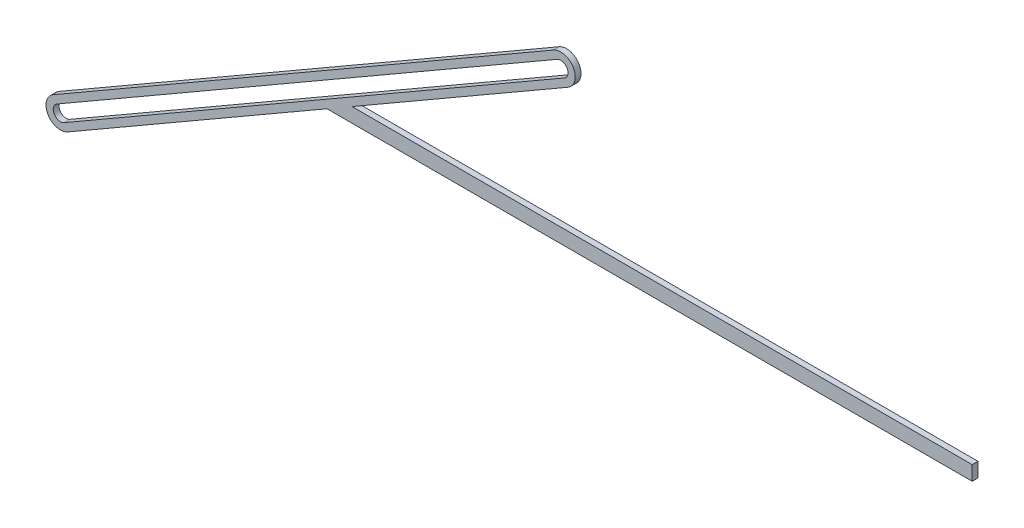
ISO-10303-21;
HEADER;
FILE_DESCRIPTION(('STEP AP214'),'2;1');
FILE_NAME('part.step','',(''),(''),'','','');
FILE_SCHEMA(('AUTOMOTIVE_DESIGN { 1 0 10303 214 1 1 1 1 }'));
ENDSEC;
DATA;
#1=APPLICATION_CONTEXT('core data for automotive mechanical design processes');
#2=APPLICATION_PROTOCOL_DEFINITION('international standard','automotive_design',2000,#1);
#3=PRODUCT_CONTEXT('',#1,'mechanical');
#4=PRODUCT('Part','Part','',(#3));
#5=PRODUCT_RELATED_PRODUCT_CATEGORY('part','',(#4));
#6=PRODUCT_DEFINITION_FORMATION('','',#4);
#7=PRODUCT_DEFINITION_CONTEXT('part definition',#1,'design');
#8=PRODUCT_DEFINITION('design','',#6,#7);
#9=PRODUCT_DEFINITION_SHAPE('','',#8);
#10=(LENGTH_UNIT() NAMED_UNIT(*) SI_UNIT(.MILLI.,.METRE.));
#11=(NAMED_UNIT(*) PLANE_ANGLE_UNIT() SI_UNIT($,.RADIAN.));
#12=(NAMED_UNIT(*) SI_UNIT($,.STERADIAN.) SOLID_ANGLE_UNIT());
#13=UNCERTAINTY_MEASURE_WITH_UNIT(LENGTH_MEASURE(1.E-05),#10,'distance_accuracy_value','');
#14=(GEOMETRIC_REPRESENTATION_CONTEXT(3) GLOBAL_UNCERTAINTY_ASSIGNED_CONTEXT((#13)) GLOBAL_UNIT_ASSIGNED_CONTEXT((#10,
#11,#12)) REPRESENTATION_CONTEXT('',''));
#15=CARTESIAN_POINT('',(0.,0.,0.));
#16=DIRECTION('',(0.,0.,1.));
#17=DIRECTION('',(1.,0.,0.));
#18=AXIS2_PLACEMENT_3D('',#15,#16,#17);
#19=CARTESIAN_POINT('',(-52.1269965372353,100.,4.));
#20=DIRECTION('',(0.,0.,1.));
#21=DIRECTION('',(1.,0.,0.));
#22=AXIS2_PLACEMENT_3D('',#19,#20,#21);
#23=PLANE('',#22);
#24=DIRECTION('',(1.,0.,0.));
#25=VECTOR('',#24,1.);
#26=CARTESIAN_POINT('',(-213.992331331968,-5.00000000000003,4.));
#27=LINE('',#26,#25);
#28=CARTESIAN_POINT('',(-213.992331331968,-5.00000000000003,4.));
#29=VERTEX_POINT('',#28);
#30=CARTESIAN_POINT('',(232.716639261511,-5.00000000000002,4.));
#31=VERTEX_POINT('',#30);
#32=EDGE_CURVE('E156',#29,#31,#27,.T.);
#33=ORIENTED_EDGE('',*,*,#32,.T.);
#34=DIRECTION('',(0.,1.,0.));
#35=VECTOR('',#34,1.);
#36=CARTESIAN_POINT('',(232.716639261511,5.00000000000001,4.));
#37=LINE('',#36,#35);
#38=CARTESIAN_POINT('',(232.716639261511,5.00000000000001,4.));
#39=VERTEX_POINT('',#38);
#40=EDGE_CURVE('E158',#31,#39,#37,.T.);
#41=ORIENTED_EDGE('',*,*,#40,.T.);
#42=DIRECTION('',(-1.,0.,0.));
#43=VECTOR('',#42,1.);
#44=CARTESIAN_POINT('',(162.432840625087,5.00000000000001,4.));
#45=LINE('',#44,#43);
#46=CARTESIAN_POINT('',(-196.671823256279,5.00000000000002,4.));
#47=VERTEX_POINT('',#46);
#48=EDGE_CURVE('E161',#39,#47,#45,.T.);
#49=ORIENTED_EDGE('',*,*,#48,.T.);
#50=DIRECTION('',(0.866025403784437,0.500000000000003,0.));
#51=VECTOR('',#50,1.);
#52=CARTESIAN_POINT('',(-196.671823256279,5.00000000000002,4.));
#53=LINE('',#52,#51);
#54=CARTESIAN_POINT('',(-47.1269965372357,91.3397459621565,4.));
#55=VERTEX_POINT('',#54);
#56=EDGE_CURVE('E163',#47,#55,#53,.T.);
#57=ORIENTED_EDGE('',*,*,#56,.T.);
#58=CARTESIAN_POINT('',(-52.1269965372353,100.,4.));
#59=DIRECTION('',(0.,0.,1.));
#60=DIRECTION('',(1.,0.,0.));
#61=AXIS2_PLACEMENT_3D('',#58,#59,#60);
#62=CIRCLE('',#61,9.99999999999931);
#63=CARTESIAN_POINT('',(-57.1269965372349,108.660254037844,4.));
#64=VERTEX_POINT('',#63);
#65=EDGE_CURVE('E165',#55,#64,#62,.T.);
#66=ORIENTED_EDGE('',*,*,#65,.T.);
#67=DIRECTION('',(-0.866025403784439,-0.5,0.));
#68=VECTOR('',#67,1.);
#69=CARTESIAN_POINT('',(-403.53715805101,-91.339745962156,4.));
#70=LINE('',#69,#68);
#71=CARTESIAN_POINT('',(-403.537158051011,-91.3397459621558,4.));
#72=VERTEX_POINT('',#71);
#73=EDGE_CURVE('E167',#64,#72,#70,.T.);
#74=ORIENTED_EDGE('',*,*,#73,.T.);
#75=CARTESIAN_POINT('',(-398.537158051011,-100.,4.));
#76=DIRECTION('',(0.,0.,1.));
#77=DIRECTION('',(1.,0.,0.));
#78=AXIS2_PLACEMENT_3D('',#75,#76,#77);
#79=CIRCLE('',#78,10.);
#80=CARTESIAN_POINT('',(-393.53715805101,-108.660254037845,4.));
#81=VERTEX_POINT('',#80);
#82=EDGE_CURVE('E169',#72,#81,#79,.T.);
#83=ORIENTED_EDGE('',*,*,#82,.T.);
#84=DIRECTION('',(0.866025403784437,0.500000000000003,0.));
#85=VECTOR('',#84,1.);
#86=CARTESIAN_POINT('',(-393.53715805101,-108.660254037845,4.));
#87=LINE('',#86,#85);
#88=EDGE_CURVE('E171',#81,#29,#87,.T.);
#89=ORIENTED_EDGE('',*,*,#88,.T.);
#90=EDGE_LOOP('',(#33,#41,#49,#57,#66,#74,#83,#89));
#91=FACE_BOUND('',#90,.T.);
#92=DIRECTION('',(0.866025403784438,0.500000000000002,0.));
#93=VECTOR('',#92,1.);
#94=CARTESIAN_POINT('',(-396.03715805101,-104.330127018923,4.));
#95=LINE('',#94,#93);
#96=CARTESIAN_POINT('',(-396.03715805101,-104.330127018923,4.));
#97=VERTEX_POINT('',#96);
#98=CARTESIAN_POINT('',(-49.6269965372355,95.6698729810783,4.));
#99=VERTEX_POINT('',#98);
#100=EDGE_CURVE('E128',#97,#99,#95,.T.);
#101=ORIENTED_EDGE('',*,*,#100,.F.);
#102=CARTESIAN_POINT('',(-398.537158051011,-100.,4.));
#103=DIRECTION('',(0.,0.,1.));
#104=DIRECTION('',(1.,0.,0.));
#105=AXIS2_PLACEMENT_3D('',#102,#103,#104);
#106=CIRCLE('',#105,5.00000000000002);
#107=CARTESIAN_POINT('',(-401.03715805101,-95.6698729810782,4.));
#108=VERTEX_POINT('',#107);
#109=EDGE_CURVE('E120',#108,#97,#106,.T.);
#110=ORIENTED_EDGE('',*,*,#109,.F.);
#111=DIRECTION('',(-0.866025403784438,-0.5,0.));
#112=VECTOR('',#111,1.);
#113=CARTESIAN_POINT('',(-401.03715805101,-95.6698729810782,4.));
#114=LINE('',#113,#112);
#115=CARTESIAN_POINT('',(-54.6269965372349,104.330127018922,4.));
#116=VERTEX_POINT('',#115);
#117=EDGE_CURVE('E142',#116,#108,#114,.T.);
#118=ORIENTED_EDGE('',*,*,#117,.F.);
#119=CARTESIAN_POINT('',(-52.1269965372353,100.,4.));
#120=DIRECTION('',(0.,0.,1.));
#121=DIRECTION('',(1.,0.,0.));
#122=AXIS2_PLACEMENT_3D('',#119,#120,#121);
#123=CIRCLE('',#122,4.99999999999968);
#124=EDGE_CURVE('E140',#99,#116,#123,.T.);
#125=ORIENTED_EDGE('',*,*,#124,.F.);
#126=EDGE_LOOP('',(#101,#110,#118,#125));
#127=FACE_BOUND('',#126,.T.);
#128=ADVANCED_FACE('F31',(#91,#127),#23,.T.);
#129=CARTESIAN_POINT('',(-52.1269965372353,100.,0.));
#130=DIRECTION('',(0.,0.,1.));
#131=DIRECTION('',(1.,0.,0.));
#132=AXIS2_PLACEMENT_3D('',#129,#130,#131);
#133=PLANE('',#132);
#134=DIRECTION('',(1.,0.,0.));
#135=VECTOR('',#134,1.);
#136=CARTESIAN_POINT('',(232.716639261511,-5.00000000000002,0.));
#137=LINE('',#136,#135);
#138=CARTESIAN_POINT('',(-213.992331331968,-5.00000000000003,0.));
#139=VERTEX_POINT('',#138);
#140=CARTESIAN_POINT('',(232.716639261511,-5.00000000000002,0.));
#141=VERTEX_POINT('',#140);
#142=EDGE_CURVE('E136',#139,#141,#137,.T.);
#143=ORIENTED_EDGE('',*,*,#142,.F.);
#144=DIRECTION('',(0.866025403784437,0.500000000000003,0.));
#145=VECTOR('',#144,1.);
#146=CARTESIAN_POINT('',(-393.53715805101,-108.660254037845,0.));
#147=LINE('',#146,#145);
#148=CARTESIAN_POINT('',(-393.53715805101,-108.660254037845,0.));
#149=VERTEX_POINT('',#148);
#150=EDGE_CURVE('E159',#149,#139,#147,.T.);
#151=ORIENTED_EDGE('',*,*,#150,.F.);
#152=CARTESIAN_POINT('',(-398.537158051011,-100.,0.));
#153=DIRECTION('',(0.,0.,1.));
#154=DIRECTION('',(1.,0.,0.));
#155=AXIS2_PLACEMENT_3D('',#152,#153,#154);
#156=CIRCLE('',#155,10.);
#157=CARTESIAN_POINT('',(-403.537158051011,-91.3397459621558,0.));
#158=VERTEX_POINT('',#157);
#159=EDGE_CURVE('E186',#158,#149,#156,.T.);
#160=ORIENTED_EDGE('',*,*,#159,.F.);
#161=DIRECTION('',(-0.866025403784439,-0.5,0.));
#162=VECTOR('',#161,1.);
#163=CARTESIAN_POINT('',(-403.53715805101,-91.339745962156,0.));
#164=LINE('',#163,#162);
#165=CARTESIAN_POINT('',(-57.1269965372349,108.660254037844,0.));
#166=VERTEX_POINT('',#165);
#167=EDGE_CURVE('E184',#166,#158,#164,.T.);
#168=ORIENTED_EDGE('',*,*,#167,.F.);
#169=CARTESIAN_POINT('',(-52.1269965372353,100.,0.));
#170=DIRECTION('',(0.,0.,1.));
#171=DIRECTION('',(1.,0.,0.));
#172=AXIS2_PLACEMENT_3D('',#169,#170,#171);
#173=CIRCLE('',#172,9.99999999999931);
#174=CARTESIAN_POINT('',(-47.1269965372357,91.3397459621565,0.));
#175=VERTEX_POINT('',#174);
#176=EDGE_CURVE('E182',#175,#166,#173,.T.);
#177=ORIENTED_EDGE('',*,*,#176,.F.);
#178=DIRECTION('',(0.866025403784437,0.500000000000003,0.));
#179=VECTOR('',#178,1.);
#180=CARTESIAN_POINT('',(-196.671823256279,5.00000000000002,0.));
#181=LINE('',#180,#179);
#182=CARTESIAN_POINT('',(-196.671823256279,5.00000000000002,0.));
#183=VERTEX_POINT('',#182);
#184=EDGE_CURVE('E180',#183,#175,#181,.T.);
#185=ORIENTED_EDGE('',*,*,#184,.F.);
#186=DIRECTION('',(-1.,0.,0.));
#187=VECTOR('',#186,1.);
#188=CARTESIAN_POINT('',(-196.671823256279,5.00000000000002,0.));
#189=LINE('',#188,#187);
#190=CARTESIAN_POINT('',(232.716639261511,5.00000000000001,0.));
#191=VERTEX_POINT('',#190);
#192=EDGE_CURVE('E178',#191,#183,#189,.T.);
#193=ORIENTED_EDGE('',*,*,#192,.F.);
#194=DIRECTION('',(0.,1.,0.));
#195=VECTOR('',#194,1.);
#196=CARTESIAN_POINT('',(232.716639261511,5.00000000000001,0.));
#197=LINE('',#196,#195);
#198=EDGE_CURVE('E175',#141,#191,#197,.T.);
#199=ORIENTED_EDGE('',*,*,#198,.F.);
#200=EDGE_LOOP('',(#143,#151,#160,#168,#177,#185,#193,#199));
#201=FACE_BOUND('',#200,.T.);
#202=CARTESIAN_POINT('',(-398.537158051011,-100.,0.));
#203=DIRECTION('',(0.,0.,1.));
#204=DIRECTION('',(1.,0.,0.));
#205=AXIS2_PLACEMENT_3D('',#202,#203,#204);
#206=CIRCLE('',#205,5.00000000000002);
#207=CARTESIAN_POINT('',(-401.03715805101,-95.6698729810782,0.));
#208=VERTEX_POINT('',#207);
#209=CARTESIAN_POINT('',(-396.03715805101,-104.330127018923,0.));
#210=VERTEX_POINT('',#209);
#211=EDGE_CURVE('E54',#208,#210,#206,.T.);
#212=ORIENTED_EDGE('',*,*,#211,.T.);
#213=DIRECTION('',(0.866025403784438,0.500000000000002,0.));
#214=VECTOR('',#213,1.);
#215=CARTESIAN_POINT('',(-396.03715805101,-104.330127018923,0.));
#216=LINE('',#215,#214);
#217=CARTESIAN_POINT('',(-49.6269965372355,95.6698729810783,0.));
#218=VERTEX_POINT('',#217);
#219=EDGE_CURVE('E135',#210,#218,#216,.T.);
#220=ORIENTED_EDGE('',*,*,#219,.T.);
#221=CARTESIAN_POINT('',(-52.1269965372353,100.,0.));
#222=DIRECTION('',(0.,0.,1.));
#223=DIRECTION('',(1.,0.,0.));
#224=AXIS2_PLACEMENT_3D('',#221,#222,#223);
#225=CIRCLE('',#224,4.99999999999968);
#226=CARTESIAN_POINT('',(-54.6269965372349,104.330127018922,0.));
#227=VERTEX_POINT('',#226);
#228=EDGE_CURVE('E148',#218,#227,#225,.T.);
#229=ORIENTED_EDGE('',*,*,#228,.T.);
#230=DIRECTION('',(-0.866025403784438,-0.5,0.));
#231=VECTOR('',#230,1.);
#232=CARTESIAN_POINT('',(-401.03715805101,-95.6698729810782,0.));
#233=LINE('',#232,#231);
#234=EDGE_CURVE('E129',#227,#208,#233,.T.);
#235=ORIENTED_EDGE('',*,*,#234,.T.);
#236=EDGE_LOOP('',(#212,#220,#229,#235));
#237=FACE_BOUND('',#236,.T.);
#238=ADVANCED_FACE('F218',(#201,#237),#133,.F.);
#239=CARTESIAN_POINT('',(232.716639261511,-5.00000000000002,4.));
#240=DIRECTION('',(0.,1.,0.));
#241=DIRECTION('',(0.,0.,1.));
#242=AXIS2_PLACEMENT_3D('',#239,#240,#241);
#243=PLANE('',#242);
#244=ORIENTED_EDGE('',*,*,#142,.T.);
#245=DIRECTION('',(0.,0.,-1.));
#246=VECTOR('',#245,1.);
#247=CARTESIAN_POINT('',(232.716639261511,-5.00000000000002,4.));
#248=LINE('',#247,#246);
#249=EDGE_CURVE('E11',#31,#141,#248,.T.);
#250=ORIENTED_EDGE('',*,*,#249,.F.);
#251=ORIENTED_EDGE('',*,*,#32,.F.);
#252=DIRECTION('',(0.,0.,-1.));
#253=VECTOR('',#252,1.);
#254=CARTESIAN_POINT('',(-213.992331331968,-5.00000000000003,4.));
#255=LINE('',#254,#253);
#256=EDGE_CURVE('E173',#29,#139,#255,.T.);
#257=ORIENTED_EDGE('',*,*,#256,.T.);
#258=EDGE_LOOP('',(#244,#250,#251,#257));
#259=FACE_BOUND('',#258,.T.);
#260=ADVANCED_FACE('F33',(#259),#243,.F.);
#261=CARTESIAN_POINT('',(232.716639261511,5.00000000000001,4.));
#262=DIRECTION('',(-1.,0.,0.));
#263=DIRECTION('',(0.,0.,1.));
#264=AXIS2_PLACEMENT_3D('',#261,#262,#263);
#265=PLANE('',#264);
#266=ORIENTED_EDGE('',*,*,#198,.T.);
#267=DIRECTION('',(0.,0.,-1.));
#268=VECTOR('',#267,1.);
#269=CARTESIAN_POINT('',(232.716639261511,5.00000000000001,4.));
#270=LINE('',#269,#268);
#271=EDGE_CURVE('E39',#39,#191,#270,.T.);
#272=ORIENTED_EDGE('',*,*,#271,.F.);
#273=ORIENTED_EDGE('',*,*,#40,.F.);
#274=ORIENTED_EDGE('',*,*,#249,.T.);
#275=EDGE_LOOP('',(#266,#272,#273,#274));
#276=FACE_BOUND('',#275,.T.);
#277=ADVANCED_FACE('F214',(#276),#265,.F.);
#278=CARTESIAN_POINT('',(-196.671823256279,5.00000000000002,4.));
#279=DIRECTION('',(0.,-1.,0.));
#280=DIRECTION('',(1.,0.,0.));
#281=AXIS2_PLACEMENT_3D('',#278,#279,#280);
#282=PLANE('',#281);
#283=ORIENTED_EDGE('',*,*,#192,.T.);
#284=DIRECTION('',(0.,0.,-1.));
#285=VECTOR('',#284,1.);
#286=CARTESIAN_POINT('',(-196.671823256279,5.00000000000002,4.));
#287=LINE('',#286,#285);
#288=EDGE_CURVE('E204',#47,#183,#287,.T.);
#289=ORIENTED_EDGE('',*,*,#288,.F.);
#290=ORIENTED_EDGE('',*,*,#48,.F.);
#291=ORIENTED_EDGE('',*,*,#271,.T.);
#292=EDGE_LOOP('',(#283,#289,#290,#291));
#293=FACE_BOUND('',#292,.T.);
#294=ADVANCED_FACE('F210',(#293),#282,.F.);
#295=CARTESIAN_POINT('',(-196.671823256279,5.00000000000002,4.));
#296=DIRECTION('',(-0.500000000000003,0.866025403784437,0.));
#297=DIRECTION('',(-0.866025403784437,-0.500000000000003,0.));
#298=AXIS2_PLACEMENT_3D('',#295,#296,#297);
#299=PLANE('',#298);
#300=ORIENTED_EDGE('',*,*,#184,.T.);
#301=DIRECTION('',(0.,0.,-1.));
#302=VECTOR('',#301,1.);
#303=CARTESIAN_POINT('',(-47.1269965372357,91.3397459621565,4.));
#304=LINE('',#303,#302);
#305=EDGE_CURVE('E201',#55,#175,#304,.T.);
#306=ORIENTED_EDGE('',*,*,#305,.F.);
#307=ORIENTED_EDGE('',*,*,#56,.F.);
#308=ORIENTED_EDGE('',*,*,#288,.T.);
#309=EDGE_LOOP('',(#300,#306,#307,#308));
#310=FACE_BOUND('',#309,.T.);
#311=ADVANCED_FACE('F226',(#310),#299,.F.);
#312=CARTESIAN_POINT('',(-52.1269965372353,100.,4.));
#313=DIRECTION('',(0.,0.,-1.));
#314=DIRECTION('',(-1.,0.,0.));
#315=AXIS2_PLACEMENT_3D('',#312,#313,#314);
#316=CYLINDRICAL_SURFACE('',#315,9.99999999999931);
#317=ORIENTED_EDGE('',*,*,#176,.T.);
#318=DIRECTION('',(0.,0.,-1.));
#319=VECTOR('',#318,1.);
#320=CARTESIAN_POINT('',(-57.1269965372349,108.660254037844,4.));
#321=LINE('',#320,#319);
#322=EDGE_CURVE('E198',#64,#166,#321,.T.);
#323=ORIENTED_EDGE('',*,*,#322,.F.);
#324=ORIENTED_EDGE('',*,*,#65,.F.);
#325=ORIENTED_EDGE('',*,*,#305,.T.);
#326=EDGE_LOOP('',(#317,#323,#324,#325));
#327=FACE_BOUND('',#326,.T.);
#328=ADVANCED_FACE('F230',(#327),#316,.T.);
#329=CARTESIAN_POINT('',(-403.53715805101,-91.339745962156,4.));
#330=DIRECTION('',(0.5,-0.866025403784439,0.));
#331=DIRECTION('',(0.866025403784439,0.5,0.));
#332=AXIS2_PLACEMENT_3D('',#329,#330,#331);
#333=PLANE('',#332);
#334=ORIENTED_EDGE('',*,*,#167,.T.);
#335=DIRECTION('',(0.,0.,-1.));
#336=VECTOR('',#335,1.);
#337=CARTESIAN_POINT('',(-403.537158051011,-91.3397459621558,4.));
#338=LINE('',#337,#336);
#339=EDGE_CURVE('E195',#72,#158,#338,.T.);
#340=ORIENTED_EDGE('',*,*,#339,.F.);
#341=ORIENTED_EDGE('',*,*,#73,.F.);
#342=ORIENTED_EDGE('',*,*,#322,.T.);
#343=EDGE_LOOP('',(#334,#340,#341,#342));
#344=FACE_BOUND('',#343,.T.);
#345=ADVANCED_FACE('F247',(#344),#333,.F.);
#346=CARTESIAN_POINT('',(-398.537158051011,-100.,4.));
#347=DIRECTION('',(0.,0.,-1.));
#348=DIRECTION('',(-1.,0.,0.));
#349=AXIS2_PLACEMENT_3D('',#346,#347,#348);
#350=CYLINDRICAL_SURFACE('',#349,10.);
#351=ORIENTED_EDGE('',*,*,#159,.T.);
#352=DIRECTION('',(0.,0.,-1.));
#353=VECTOR('',#352,1.);
#354=CARTESIAN_POINT('',(-393.53715805101,-108.660254037845,4.));
#355=LINE('',#354,#353);
#356=EDGE_CURVE('E192',#81,#149,#355,.T.);
#357=ORIENTED_EDGE('',*,*,#356,.F.);
#358=ORIENTED_EDGE('',*,*,#82,.F.);
#359=ORIENTED_EDGE('',*,*,#339,.T.);
#360=EDGE_LOOP('',(#351,#357,#358,#359));
#361=FACE_BOUND('',#360,.T.);
#362=ADVANCED_FACE('F244',(#361),#350,.T.);
#363=CARTESIAN_POINT('',(-393.53715805101,-108.660254037845,4.));
#364=DIRECTION('',(-0.500000000000003,0.866025403784437,0.));
#365=DIRECTION('',(-0.866025403784437,-0.500000000000003,0.));
#366=AXIS2_PLACEMENT_3D('',#363,#364,#365);
#367=PLANE('',#366);
#368=ORIENTED_EDGE('',*,*,#150,.T.);
#369=ORIENTED_EDGE('',*,*,#256,.F.);
#370=ORIENTED_EDGE('',*,*,#88,.F.);
#371=ORIENTED_EDGE('',*,*,#356,.T.);
#372=EDGE_LOOP('',(#368,#369,#370,#371));
#373=FACE_BOUND('',#372,.T.);
#374=ADVANCED_FACE('F240',(#373),#367,.F.);
#375=CARTESIAN_POINT('',(-398.537158051011,-100.,4.));
#376=DIRECTION('',(0.,0.,-1.));
#377=DIRECTION('',(-1.,0.,0.));
#378=AXIS2_PLACEMENT_3D('',#375,#376,#377);
#379=CYLINDRICAL_SURFACE('',#378,5.00000000000002);
#380=ORIENTED_EDGE('',*,*,#211,.F.);
#381=DIRECTION('',(0.,0.,-1.));
#382=VECTOR('',#381,1.);
#383=CARTESIAN_POINT('',(-401.03715805101,-95.6698729810782,4.));
#384=LINE('',#383,#382);
#385=EDGE_CURVE('E124',#108,#208,#384,.T.);
#386=ORIENTED_EDGE('',*,*,#385,.F.);
#387=ORIENTED_EDGE('',*,*,#109,.T.);
#388=DIRECTION('',(0.,0.,-1.));
#389=VECTOR('',#388,1.);
#390=CARTESIAN_POINT('',(-396.03715805101,-104.330127018923,4.));
#391=LINE('',#390,#389);
#392=EDGE_CURVE('E123',#97,#210,#391,.T.);
#393=ORIENTED_EDGE('',*,*,#392,.T.);
#394=EDGE_LOOP('',(#380,#386,#387,#393));
#395=FACE_BOUND('',#394,.T.);
#396=ADVANCED_FACE('F122',(#395),#379,.F.);
#397=CARTESIAN_POINT('',(-396.03715805101,-104.330127018923,4.));
#398=DIRECTION('',(-0.500000000000002,0.866025403784438,0.));
#399=DIRECTION('',(-0.866025403784438,-0.500000000000002,0.));
#400=AXIS2_PLACEMENT_3D('',#397,#398,#399);
#401=PLANE('',#400);
#402=ORIENTED_EDGE('',*,*,#219,.F.);
#403=ORIENTED_EDGE('',*,*,#392,.F.);
#404=ORIENTED_EDGE('',*,*,#100,.T.);
#405=DIRECTION('',(0.,0.,-1.));
#406=VECTOR('',#405,1.);
#407=CARTESIAN_POINT('',(-49.6269965372355,95.6698729810783,4.));
#408=LINE('',#407,#406);
#409=EDGE_CURVE('E137',#99,#218,#408,.T.);
#410=ORIENTED_EDGE('',*,*,#409,.T.);
#411=EDGE_LOOP('',(#402,#403,#404,#410));
#412=FACE_BOUND('',#411,.T.);
#413=ADVANCED_FACE('F132',(#412),#401,.T.);
#414=CARTESIAN_POINT('',(-52.1269965372353,100.,4.));
#415=DIRECTION('',(0.,0.,-1.));
#416=DIRECTION('',(-1.,0.,0.));
#417=AXIS2_PLACEMENT_3D('',#414,#415,#416);
#418=CYLINDRICAL_SURFACE('',#417,4.99999999999968);
#419=ORIENTED_EDGE('',*,*,#228,.F.);
#420=ORIENTED_EDGE('',*,*,#409,.F.);
#421=ORIENTED_EDGE('',*,*,#124,.T.);
#422=DIRECTION('',(0.,0.,-1.));
#423=VECTOR('',#422,1.);
#424=CARTESIAN_POINT('',(-54.6269965372349,104.330127018922,4.));
#425=LINE('',#424,#423);
#426=EDGE_CURVE('E46',#116,#227,#425,.T.);
#427=ORIENTED_EDGE('',*,*,#426,.T.);
#428=EDGE_LOOP('',(#419,#420,#421,#427));
#429=FACE_BOUND('',#428,.T.);
#430=ADVANCED_FACE('F272',(#429),#418,.F.);
#431=CARTESIAN_POINT('',(-401.03715805101,-95.6698729810782,4.));
#432=DIRECTION('',(0.5,-0.866025403784439,0.));
#433=DIRECTION('',(0.866025403784439,0.5,0.));
#434=AXIS2_PLACEMENT_3D('',#431,#432,#433);
#435=PLANE('',#434);
#436=ORIENTED_EDGE('',*,*,#234,.F.);
#437=ORIENTED_EDGE('',*,*,#426,.F.);
#438=ORIENTED_EDGE('',*,*,#117,.T.);
#439=ORIENTED_EDGE('',*,*,#385,.T.);
#440=EDGE_LOOP('',(#436,#437,#438,#439));
#441=FACE_BOUND('',#440,.T.);
#442=ADVANCED_FACE('F276',(#441),#435,.T.);
#443=CLOSED_SHELL('',(#128,#238,#260,#277,#294,#311,#328,#345,#362,#374,#396,#413,#430,#442));
#444=MANIFOLD_SOLID_BREP('B2',#443);
#445=ADVANCED_BREP_SHAPE_REPRESENTATION('',(#18,#444),#14);
#446=SHAPE_DEFINITION_REPRESENTATION(#9,#445);
ENDSEC;
END-ISO-10303-21;
